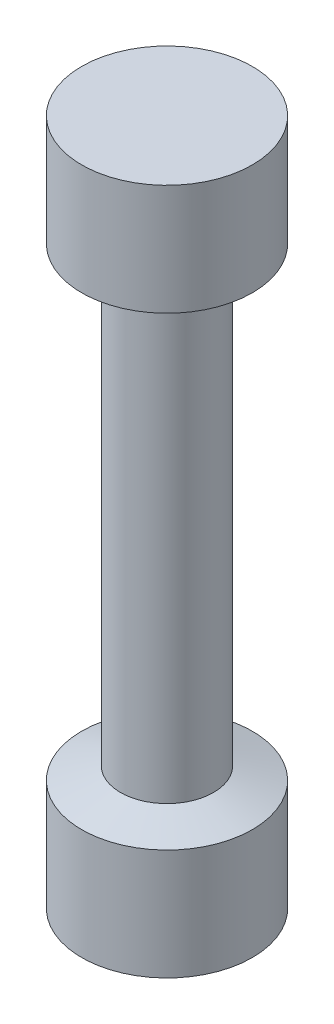
ISO-10303-21;
HEADER;
FILE_DESCRIPTION(('STEP AP214'),'2;1');
FILE_NAME('part.step','',(''),(''),'','','');
FILE_SCHEMA(('AUTOMOTIVE_DESIGN { 1 0 10303 214 1 1 1 1 }'));
ENDSEC;
DATA;
#1=APPLICATION_CONTEXT('core data for automotive mechanical design processes');
#2=APPLICATION_PROTOCOL_DEFINITION('international standard','automotive_design',2000,#1);
#3=PRODUCT_CONTEXT('',#1,'mechanical');
#4=PRODUCT('Part','Part','',(#3));
#5=PRODUCT_RELATED_PRODUCT_CATEGORY('part','',(#4));
#6=PRODUCT_DEFINITION_FORMATION('','',#4);
#7=PRODUCT_DEFINITION_CONTEXT('part definition',#1,'design');
#8=PRODUCT_DEFINITION('design','',#6,#7);
#9=PRODUCT_DEFINITION_SHAPE('','',#8);
#10=(LENGTH_UNIT() NAMED_UNIT(*) SI_UNIT(.MILLI.,.METRE.));
#11=(NAMED_UNIT(*) PLANE_ANGLE_UNIT() SI_UNIT($,.RADIAN.));
#12=(NAMED_UNIT(*) SI_UNIT($,.STERADIAN.) SOLID_ANGLE_UNIT());
#13=UNCERTAINTY_MEASURE_WITH_UNIT(LENGTH_MEASURE(1.E-05),#10,'distance_accuracy_value','');
#14=(GEOMETRIC_REPRESENTATION_CONTEXT(3) GLOBAL_UNCERTAINTY_ASSIGNED_CONTEXT((#13)) GLOBAL_UNIT_ASSIGNED_CONTEXT((#10,
#11,#12)) REPRESENTATION_CONTEXT('',''));
#15=CARTESIAN_POINT('',(0.,0.,0.));
#16=DIRECTION('',(0.,0.,1.));
#17=DIRECTION('',(1.,0.,0.));
#18=AXIS2_PLACEMENT_3D('',#15,#16,#17);
#19=CARTESIAN_POINT('',(0.,8.70000000000002,0.));
#20=DIRECTION('',(0.,-1.,0.));
#21=DIRECTION('',(1.,0.,0.));
#22=AXIS2_PLACEMENT_3D('',#19,#20,#21);
#23=CONICAL_SURFACE('',#22,6.69999999999997,1.25397184092668);
#24=CARTESIAN_POINT('',(0.,9.70000000000001,0.));
#25=DIRECTION('',(0.,-1.,0.));
#26=DIRECTION('',(1.,0.,0.));
#27=AXIS2_PLACEMENT_3D('',#24,#25,#26);
#28=CIRCLE('',#27,3.64999999999997);
#29=CARTESIAN_POINT('',(3.64999999999993,9.70000000000003,0.));
#30=VERTEX_POINT('',#29);
#31=EDGE_CURVE('E55',#30,#30,#28,.T.);
#32=ORIENTED_EDGE('',*,*,#31,.T.);
#33=EDGE_LOOP('',(#32));
#34=FACE_BOUND('',#33,.T.);
#35=CARTESIAN_POINT('',(0.,8.70000000000002,0.));
#36=DIRECTION('',(0.,-1.,0.));
#37=DIRECTION('',(1.,0.,0.));
#38=AXIS2_PLACEMENT_3D('',#35,#36,#37);
#39=CIRCLE('',#38,6.69999999999997);
#40=CARTESIAN_POINT('',(6.69999999999994,8.70000000000004,0.));
#41=VERTEX_POINT('',#40);
#42=EDGE_CURVE('E10',#41,#41,#39,.T.);
#43=ORIENTED_EDGE('',*,*,#42,.F.);
#44=EDGE_LOOP('',(#43));
#45=FACE_BOUND('',#44,.T.);
#46=ADVANCED_FACE('F33',(#34,#45),#23,.T.);
#47=CARTESIAN_POINT('',(1.00238050017738E-13,-28.7093185641803,0.));
#48=DIRECTION('',(0.,-1.,0.));
#49=DIRECTION('',(1.,0.,0.));
#50=AXIS2_PLACEMENT_3D('',#47,#48,#49);
#51=CYLINDRICAL_SURFACE('',#50,6.69999999999998);
#52=ORIENTED_EDGE('',*,*,#42,.T.);
#53=EDGE_LOOP('',(#52));
#54=FACE_BOUND('',#53,.T.);
#55=CARTESIAN_POINT('',(0.,0.,0.));
#56=DIRECTION('',(0.,-1.,0.));
#57=DIRECTION('',(1.,0.,0.));
#58=AXIS2_PLACEMENT_3D('',#55,#56,#57);
#59=CIRCLE('',#58,6.7);
#60=CARTESIAN_POINT('',(6.7,0.,0.));
#61=VERTEX_POINT('',#60);
#62=EDGE_CURVE('E39',#61,#61,#59,.T.);
#63=ORIENTED_EDGE('',*,*,#62,.F.);
#64=EDGE_LOOP('',(#63));
#65=FACE_BOUND('',#64,.T.);
#66=ADVANCED_FACE('F73',(#54,#65),#51,.T.);
#67=CARTESIAN_POINT('',(0.,0.,0.));
#68=DIRECTION('',(0.,-1.,0.));
#69=DIRECTION('',(1.,0.,0.));
#70=AXIS2_PLACEMENT_3D('',#67,#68,#69);
#71=PLANE('',#70);
#72=ORIENTED_EDGE('',*,*,#62,.T.);
#73=EDGE_LOOP('',(#72));
#74=FACE_BOUND('',#73,.T.);
#75=ADVANCED_FACE('F77',(#74),#71,.T.);
#76=CARTESIAN_POINT('',(0.,53.9,0.));
#77=DIRECTION('',(0.,-1.,0.));
#78=DIRECTION('',(1.,0.,0.));
#79=AXIS2_PLACEMENT_3D('',#76,#77,#78);
#80=PLANE('',#79);
#81=CARTESIAN_POINT('',(-1.88190844163645E-13,53.9,0.));
#82=DIRECTION('',(0.,-1.,0.));
#83=DIRECTION('',(1.,0.,0.));
#84=AXIS2_PLACEMENT_3D('',#81,#82,#83);
#85=CIRCLE('',#84,6.69999999999981);
#86=CARTESIAN_POINT('',(6.69999999999962,53.9,0.));
#87=VERTEX_POINT('',#86);
#88=EDGE_CURVE('E43',#87,#87,#85,.T.);
#89=ORIENTED_EDGE('',*,*,#88,.F.);
#90=EDGE_LOOP('',(#89));
#91=FACE_BOUND('',#90,.T.);
#92=ADVANCED_FACE('F81',(#91),#80,.F.);
#93=CARTESIAN_POINT('',(1.00238050017738E-13,-28.7093185641803,0.));
#94=DIRECTION('',(0.,-1.,0.));
#95=DIRECTION('',(1.,0.,0.));
#96=AXIS2_PLACEMENT_3D('',#93,#94,#95);
#97=CYLINDRICAL_SURFACE('',#96,6.69999999999983);
#98=CARTESIAN_POINT('',(-1.5781495651571E-13,45.2,0.));
#99=DIRECTION('',(0.,-1.,0.));
#100=DIRECTION('',(1.,0.,0.));
#101=AXIS2_PLACEMENT_3D('',#98,#99,#100);
#102=CIRCLE('',#101,6.69999999999984);
#103=CARTESIAN_POINT('',(6.69999999999969,45.2,0.));
#104=VERTEX_POINT('',#103);
#105=EDGE_CURVE('E47',#104,#104,#102,.T.);
#106=ORIENTED_EDGE('',*,*,#105,.F.);
#107=EDGE_LOOP('',(#106));
#108=FACE_BOUND('',#107,.T.);
#109=ORIENTED_EDGE('',*,*,#88,.T.);
#110=EDGE_LOOP('',(#109));
#111=FACE_BOUND('',#110,.T.);
#112=ADVANCED_FACE('F69',(#108,#111),#97,.T.);
#113=CARTESIAN_POINT('',(-1.5781495651571E-13,45.2,0.));
#114=DIRECTION('',(0.,1.,0.));
#115=DIRECTION('',(-1.,0.,0.));
#116=AXIS2_PLACEMENT_3D('',#113,#114,#115);
#117=CONICAL_SURFACE('',#116,6.69999999999984,1.25397184092667);
#118=CARTESIAN_POINT('',(-1.54323475176866E-13,44.2,0.));
#119=DIRECTION('',(0.,-1.,0.));
#120=DIRECTION('',(1.,0.,0.));
#121=AXIS2_PLACEMENT_3D('',#118,#119,#120);
#122=CIRCLE('',#121,3.64999999999985);
#123=CARTESIAN_POINT('',(3.64999999999969,44.2,0.));
#124=VERTEX_POINT('',#123);
#125=EDGE_CURVE('E52',#124,#124,#122,.T.);
#126=ORIENTED_EDGE('',*,*,#125,.F.);
#127=EDGE_LOOP('',(#126));
#128=FACE_BOUND('',#127,.T.);
#129=ORIENTED_EDGE('',*,*,#105,.T.);
#130=EDGE_LOOP('',(#129));
#131=FACE_BOUND('',#130,.T.);
#132=ADVANCED_FACE('F63',(#128,#131),#117,.T.);
#133=CARTESIAN_POINT('',(1.00238050017738E-13,-28.7093185641803,0.));
#134=DIRECTION('',(0.,-1.,0.));
#135=DIRECTION('',(1.,0.,0.));
#136=AXIS2_PLACEMENT_3D('',#133,#134,#135);
#137=CYLINDRICAL_SURFACE('',#136,3.64999999999991);
#138=ORIENTED_EDGE('',*,*,#125,.T.);
#139=EDGE_LOOP('',(#138));
#140=FACE_BOUND('',#139,.T.);
#141=ORIENTED_EDGE('',*,*,#31,.F.);
#142=EDGE_LOOP('',(#141));
#143=FACE_BOUND('',#142,.T.);
#144=ADVANCED_FACE('F61',(#140,#143),#137,.T.);
#145=CLOSED_SHELL('',(#46,#66,#75,#92,#112,#132,#144));
#146=MANIFOLD_SOLID_BREP('B2',#145);
#147=ADVANCED_BREP_SHAPE_REPRESENTATION('',(#18,#146),#14);
#148=SHAPE_DEFINITION_REPRESENTATION(#9,#147);
ENDSEC;
END-ISO-10303-21;
